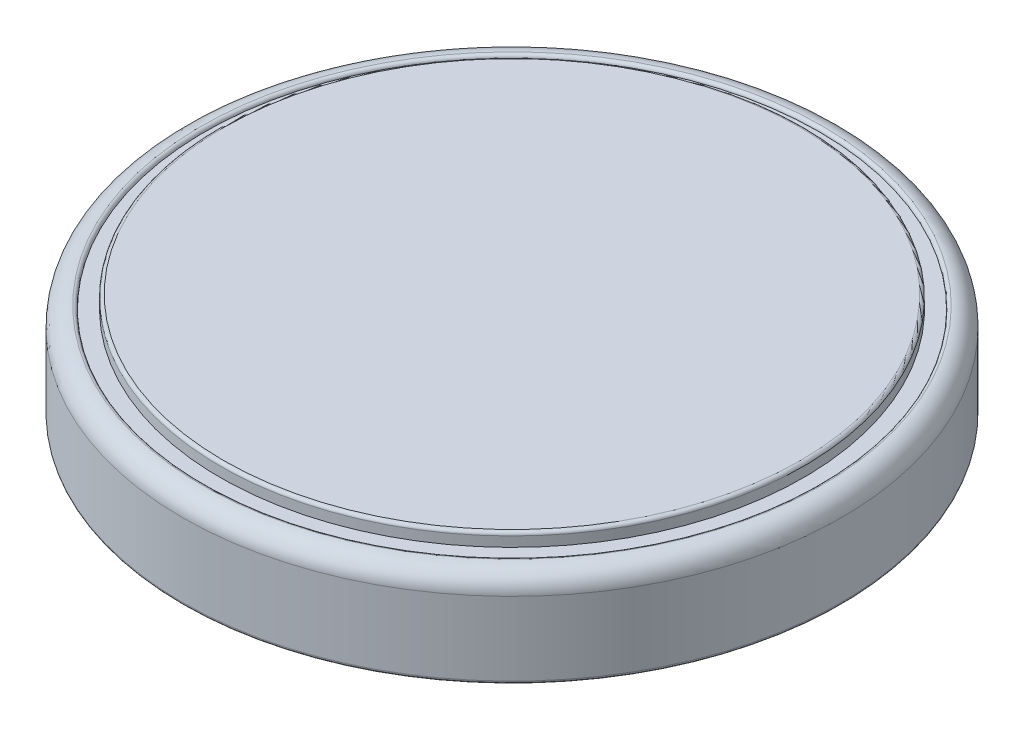
ISO-10303-21;
HEADER;
FILE_DESCRIPTION(('STEP AP214'),'2;1');
FILE_NAME('part.step','',(''),(''),'','','');
FILE_SCHEMA(('AUTOMOTIVE_DESIGN { 1 0 10303 214 1 1 1 1 }'));
ENDSEC;
DATA;
#1=APPLICATION_CONTEXT('core data for automotive mechanical design processes');
#2=APPLICATION_PROTOCOL_DEFINITION('international standard','automotive_design',2000,#1);
#3=PRODUCT_CONTEXT('',#1,'mechanical');
#4=PRODUCT('Part','Part','',(#3));
#5=PRODUCT_RELATED_PRODUCT_CATEGORY('part','',(#4));
#6=PRODUCT_DEFINITION_FORMATION('','',#4);
#7=PRODUCT_DEFINITION_CONTEXT('part definition',#1,'design');
#8=PRODUCT_DEFINITION('design','',#6,#7);
#9=PRODUCT_DEFINITION_SHAPE('','',#8);
#10=(LENGTH_UNIT() NAMED_UNIT(*) SI_UNIT(.MILLI.,.METRE.));
#11=(NAMED_UNIT(*) PLANE_ANGLE_UNIT() SI_UNIT($,.RADIAN.));
#12=(NAMED_UNIT(*) SI_UNIT($,.STERADIAN.) SOLID_ANGLE_UNIT());
#13=UNCERTAINTY_MEASURE_WITH_UNIT(LENGTH_MEASURE(1.E-05),#10,'distance_accuracy_value','');
#14=(GEOMETRIC_REPRESENTATION_CONTEXT(3) GLOBAL_UNCERTAINTY_ASSIGNED_CONTEXT((#13)) GLOBAL_UNIT_ASSIGNED_CONTEXT((#10,
#11,#12)) REPRESENTATION_CONTEXT('',''));
#15=CARTESIAN_POINT('',(0.,0.,0.));
#16=DIRECTION('',(0.,0.,1.));
#17=DIRECTION('',(1.,0.,0.));
#18=AXIS2_PLACEMENT_3D('',#15,#16,#17);
#19=CARTESIAN_POINT('',(0.,3.2,0.));
#20=DIRECTION('',(0.,1.,0.));
#21=DIRECTION('',(0.,0.,1.));
#22=AXIS2_PLACEMENT_3D('',#19,#20,#21);
#23=PLANE('',#22);
#24=CARTESIAN_POINT('',(0.,3.2,0.));
#25=DIRECTION('',(0.,-1.,0.));
#26=DIRECTION('',(0.,0.,-1.));
#27=AXIS2_PLACEMENT_3D('',#24,#25,#26);
#28=CIRCLE('',#27,8.75);
#29=CARTESIAN_POINT('',(0.,3.2,-8.75));
#30=VERTEX_POINT('',#29);
#31=EDGE_CURVE('E43',#30,#30,#28,.T.);
#32=ORIENTED_EDGE('',*,*,#31,.F.);
#33=EDGE_LOOP('',(#32));
#34=FACE_BOUND('',#33,.T.);
#35=ADVANCED_FACE('F32',(#34),#23,.T.);
#36=CARTESIAN_POINT('',(0.,3.1,0.));
#37=DIRECTION('',(0.,-1.,0.));
#38=DIRECTION('',(0.,0.,-1.));
#39=AXIS2_PLACEMENT_3D('',#36,#37,#38);
#40=TOROIDAL_SURFACE('',#39,8.75,0.0999999999999996);
#41=ORIENTED_EDGE('',*,*,#31,.T.);
#42=EDGE_LOOP('',(#41));
#43=FACE_BOUND('',#42,.T.);
#44=CARTESIAN_POINT('',(0.,3.1,0.));
#45=DIRECTION('',(0.,-1.,0.));
#46=DIRECTION('',(0.,0.,-1.));
#47=AXIS2_PLACEMENT_3D('',#44,#45,#46);
#48=CIRCLE('',#47,8.85);
#49=CARTESIAN_POINT('',(0.,3.1,-8.85));
#50=VERTEX_POINT('',#49);
#51=EDGE_CURVE('E47',#50,#50,#48,.T.);
#52=ORIENTED_EDGE('',*,*,#51,.F.);
#53=EDGE_LOOP('',(#52));
#54=FACE_BOUND('',#53,.T.);
#55=ADVANCED_FACE('F82',(#43,#54),#40,.T.);
#56=CARTESIAN_POINT('',(0.,0.,0.));
#57=DIRECTION('',(0.,-1.,0.));
#58=DIRECTION('',(0.,0.,-1.));
#59=AXIS2_PLACEMENT_3D('',#56,#57,#58);
#60=CYLINDRICAL_SURFACE('',#59,8.85);
#61=ORIENTED_EDGE('',*,*,#51,.T.);
#62=EDGE_LOOP('',(#61));
#63=FACE_BOUND('',#62,.T.);
#64=CARTESIAN_POINT('',(0.,2.8,0.));
#65=DIRECTION('',(0.,-1.,0.));
#66=DIRECTION('',(0.,0.,-1.));
#67=AXIS2_PLACEMENT_3D('',#64,#65,#66);
#68=CIRCLE('',#67,8.85);
#69=CARTESIAN_POINT('',(0.,2.8,-8.85));
#70=VERTEX_POINT('',#69);
#71=EDGE_CURVE('E52',#70,#70,#68,.T.);
#72=ORIENTED_EDGE('',*,*,#71,.F.);
#73=EDGE_LOOP('',(#72));
#74=FACE_BOUND('',#73,.T.);
#75=ADVANCED_FACE('F87',(#63,#74),#60,.T.);
#76=CARTESIAN_POINT('',(8.85,2.8,0.));
#77=DIRECTION('',(0.,1.,0.));
#78=DIRECTION('',(0.,0.,1.));
#79=AXIS2_PLACEMENT_3D('',#76,#77,#78);
#80=PLANE('',#79);
#81=ORIENTED_EDGE('',*,*,#71,.T.);
#82=EDGE_LOOP('',(#81));
#83=FACE_BOUND('',#82,.T.);
#84=CARTESIAN_POINT('',(0.,2.8,0.));
#85=DIRECTION('',(0.,-1.,0.));
#86=DIRECTION('',(0.,0.,-1.));
#87=AXIS2_PLACEMENT_3D('',#84,#85,#86);
#88=CIRCLE('',#87,9.325);
#89=CARTESIAN_POINT('',(0.,2.8,-9.325));
#90=VERTEX_POINT('',#89);
#91=EDGE_CURVE('E55',#90,#90,#88,.T.);
#92=ORIENTED_EDGE('',*,*,#91,.F.);
#93=EDGE_LOOP('',(#92));
#94=FACE_BOUND('',#93,.T.);
#95=ADVANCED_FACE('F78',(#83,#94),#80,.T.);
#96=CARTESIAN_POINT('',(0.,2.8,0.));
#97=DIRECTION('',(0.,-1.,0.));
#98=DIRECTION('',(0.,0.,-1.));
#99=AXIS2_PLACEMENT_3D('',#96,#97,#98);
#100=TOROIDAL_SURFACE('',#99,9.425,0.0999999999999996);
#101=ORIENTED_EDGE('',*,*,#91,.T.);
#102=EDGE_LOOP('',(#101));
#103=FACE_BOUND('',#102,.T.);
#104=CARTESIAN_POINT('',(0.,2.9,0.));
#105=DIRECTION('',(0.,-1.,0.));
#106=DIRECTION('',(0.,0.,-1.));
#107=AXIS2_PLACEMENT_3D('',#104,#105,#106);
#108=CIRCLE('',#107,9.425);
#109=CARTESIAN_POINT('',(0.,2.9,-9.425));
#110=VERTEX_POINT('',#109);
#111=EDGE_CURVE('E58',#110,#110,#108,.T.);
#112=ORIENTED_EDGE('',*,*,#111,.F.);
#113=EDGE_LOOP('',(#112));
#114=FACE_BOUND('',#113,.T.);
#115=ADVANCED_FACE('F69',(#103,#114),#100,.T.);
#116=CARTESIAN_POINT('',(0.,2.325,0.));
#117=DIRECTION('',(0.,-1.,0.));
#118=DIRECTION('',(0.,0.,-1.));
#119=AXIS2_PLACEMENT_3D('',#116,#117,#118);
#120=TOROIDAL_SURFACE('',#119,9.425,0.575000000000001);
#121=ORIENTED_EDGE('',*,*,#111,.T.);
#122=EDGE_LOOP('',(#121));
#123=FACE_BOUND('',#122,.T.);
#124=CARTESIAN_POINT('',(0.,2.325,0.));
#125=DIRECTION('',(0.,-1.,0.));
#126=DIRECTION('',(0.,0.,-1.));
#127=AXIS2_PLACEMENT_3D('',#124,#125,#126);
#128=CIRCLE('',#127,10.);
#129=CARTESIAN_POINT('',(0.,2.325,-10.));
#130=VERTEX_POINT('',#129);
#131=EDGE_CURVE('E61',#130,#130,#128,.T.);
#132=ORIENTED_EDGE('',*,*,#131,.F.);
#133=EDGE_LOOP('',(#132));
#134=FACE_BOUND('',#133,.T.);
#135=ADVANCED_FACE('F67',(#123,#134),#120,.T.);
#136=CARTESIAN_POINT('',(0.,0.,0.));
#137=DIRECTION('',(0.,-1.,0.));
#138=DIRECTION('',(0.,0.,-1.));
#139=AXIS2_PLACEMENT_3D('',#136,#137,#138);
#140=CYLINDRICAL_SURFACE('',#139,10.);
#141=CARTESIAN_POINT('',(0.,0.1,0.));
#142=DIRECTION('',(0.,-1.,0.));
#143=DIRECTION('',(0.,0.,-1.));
#144=AXIS2_PLACEMENT_3D('',#141,#142,#143);
#145=CIRCLE('',#144,10.);
#146=CARTESIAN_POINT('',(0.,0.1,-10.));
#147=VERTEX_POINT('',#146);
#148=EDGE_CURVE('E10',#147,#147,#145,.F.);
#149=ORIENTED_EDGE('',*,*,#148,.T.);
#150=EDGE_LOOP('',(#149));
#151=FACE_BOUND('',#150,.T.);
#152=ORIENTED_EDGE('',*,*,#131,.T.);
#153=EDGE_LOOP('',(#152));
#154=FACE_BOUND('',#153,.T.);
#155=ADVANCED_FACE('F65',(#151,#154),#140,.T.);
#156=CARTESIAN_POINT('',(0.,0.,0.));
#157=DIRECTION('',(0.,-1.,0.));
#158=DIRECTION('',(0.,0.,-1.));
#159=AXIS2_PLACEMENT_3D('',#156,#157,#158);
#160=PLANE('',#159);
#161=CARTESIAN_POINT('',(0.,0.,0.));
#162=DIRECTION('',(0.,-1.,0.));
#163=DIRECTION('',(0.,0.,-1.));
#164=AXIS2_PLACEMENT_3D('',#161,#162,#163);
#165=CIRCLE('',#164,9.9);
#166=CARTESIAN_POINT('',(0.,0.,-9.9));
#167=VERTEX_POINT('',#166);
#168=EDGE_CURVE('E39',#167,#167,#165,.T.);
#169=ORIENTED_EDGE('',*,*,#168,.T.);
#170=EDGE_LOOP('',(#169));
#171=FACE_BOUND('',#170,.T.);
#172=ADVANCED_FACE('F76',(#171),#160,.T.);
#173=CARTESIAN_POINT('',(0.,0.1,0.));
#174=DIRECTION('',(0.,-1.,0.));
#175=DIRECTION('',(0.,0.,-1.));
#176=AXIS2_PLACEMENT_3D('',#173,#174,#175);
#177=TOROIDAL_SURFACE('',#176,9.9,0.1);
#178=ORIENTED_EDGE('',*,*,#148,.F.);
#179=EDGE_LOOP('',(#178));
#180=FACE_BOUND('',#179,.T.);
#181=ORIENTED_EDGE('',*,*,#168,.F.);
#182=EDGE_LOOP('',(#181));
#183=FACE_BOUND('',#182,.T.);
#184=ADVANCED_FACE('F34',(#180,#183),#177,.T.);
#185=CLOSED_SHELL('',(#35,#55,#75,#95,#115,#135,#155,#172,#184));
#186=MANIFOLD_SOLID_BREP('B2',#185);
#187=ADVANCED_BREP_SHAPE_REPRESENTATION('',(#18,#186),#14);
#188=SHAPE_DEFINITION_REPRESENTATION(#9,#187);
ENDSEC;
END-ISO-10303-21;
